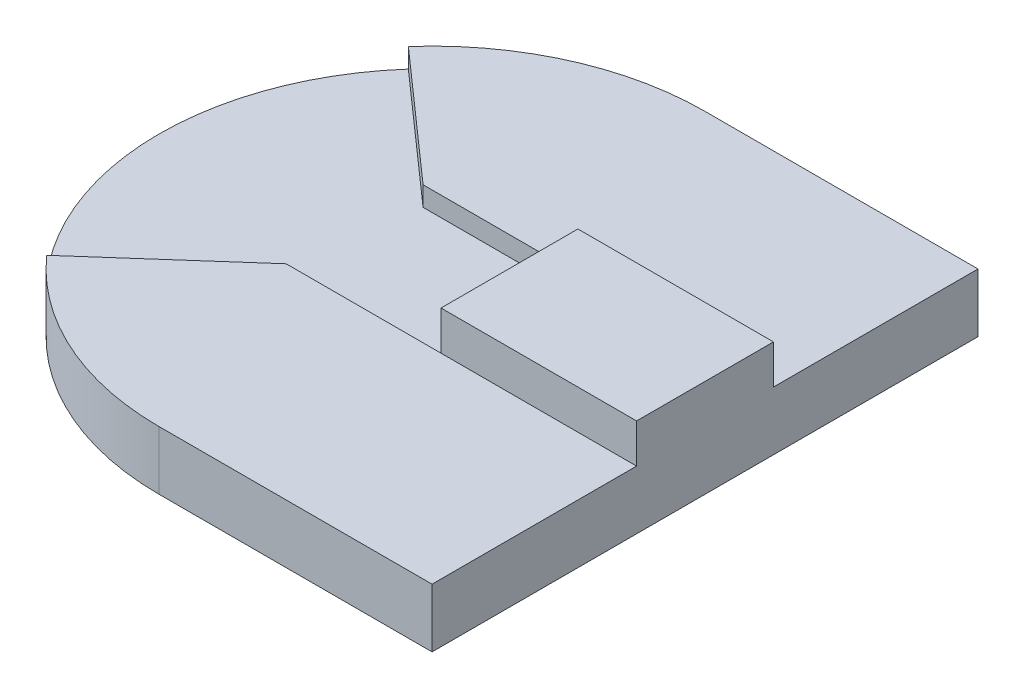
ISO-10303-21;
HEADER;
FILE_DESCRIPTION(('STEP AP214'),'2;1');
FILE_NAME('part.step','',(''),(''),'','','');
FILE_SCHEMA(('AUTOMOTIVE_DESIGN { 1 0 10303 214 1 1 1 1 }'));
ENDSEC;
DATA;
#1=APPLICATION_CONTEXT('core data for automotive mechanical design processes');
#2=APPLICATION_PROTOCOL_DEFINITION('international standard','automotive_design',2000,#1);
#3=PRODUCT_CONTEXT('',#1,'mechanical');
#4=PRODUCT('Part','Part','',(#3));
#5=PRODUCT_RELATED_PRODUCT_CATEGORY('part','',(#4));
#6=PRODUCT_DEFINITION_FORMATION('','',#4);
#7=PRODUCT_DEFINITION_CONTEXT('part definition',#1,'design');
#8=PRODUCT_DEFINITION('design','',#6,#7);
#9=PRODUCT_DEFINITION_SHAPE('','',#8);
#10=(LENGTH_UNIT() NAMED_UNIT(*) SI_UNIT(.MILLI.,.METRE.));
#11=(NAMED_UNIT(*) PLANE_ANGLE_UNIT() SI_UNIT($,.RADIAN.));
#12=(NAMED_UNIT(*) SI_UNIT($,.STERADIAN.) SOLID_ANGLE_UNIT());
#13=UNCERTAINTY_MEASURE_WITH_UNIT(LENGTH_MEASURE(1.E-05),#10,'distance_accuracy_value','');
#14=(GEOMETRIC_REPRESENTATION_CONTEXT(3) GLOBAL_UNCERTAINTY_ASSIGNED_CONTEXT((#13)) GLOBAL_UNIT_ASSIGNED_CONTEXT((#10,
#11,#12)) REPRESENTATION_CONTEXT('',''));
#15=CARTESIAN_POINT('',(0.,0.,0.));
#16=DIRECTION('',(0.,0.,1.));
#17=DIRECTION('',(1.,0.,0.));
#18=AXIS2_PLACEMENT_3D('',#15,#16,#17);
#19=CARTESIAN_POINT('',(-10.4038870848723,2.,0.));
#20=DIRECTION('',(0.,-1.,0.));
#21=DIRECTION('',(0.,0.,-1.));
#22=AXIS2_PLACEMENT_3D('',#19,#20,#21);
#23=CYLINDRICAL_SURFACE('',#22,13.958534191634);
#24=CARTESIAN_POINT('',(-10.4038870848723,0.,0.));
#25=DIRECTION('',(0.,1.,0.));
#26=DIRECTION('',(0.,0.,1.));
#27=AXIS2_PLACEMENT_3D('',#24,#25,#26);
#28=CIRCLE('',#27,13.958534191634);
#29=CARTESIAN_POINT('',(-10.4038870848723,0.,-13.958534191634));
#30=VERTEX_POINT('',#29);
#31=CARTESIAN_POINT('',(-10.4038870848723,0.,13.958534191634));
#32=VERTEX_POINT('',#31);
#33=EDGE_CURVE('E44',#30,#32,#28,.T.);
#34=ORIENTED_EDGE('',*,*,#33,.T.);
#35=DIRECTION('',(0.,-1.,0.));
#36=VECTOR('',#35,1.);
#37=CARTESIAN_POINT('',(-10.4038870848723,3.,13.958534191634));
#38=LINE('',#37,#36);
#39=CARTESIAN_POINT('',(-10.4038870848723,3.,13.958534191634));
#40=VERTEX_POINT('',#39);
#41=EDGE_CURVE('E206',#40,#32,#38,.T.);
#42=ORIENTED_EDGE('',*,*,#41,.F.);
#43=CARTESIAN_POINT('',(-10.4038870848723,3.,0.));
#44=DIRECTION('',(0.,1.,0.));
#45=DIRECTION('',(0.,0.,1.));
#46=AXIS2_PLACEMENT_3D('',#43,#44,#45);
#47=CIRCLE('',#46,13.958534191634);
#48=CARTESIAN_POINT('',(-20.8611147476651,3.,9.2459216083383));
#49=VERTEX_POINT('',#48);
#50=EDGE_CURVE('E180',#49,#40,#47,.T.);
#51=ORIENTED_EDGE('',*,*,#50,.F.);
#52=DIRECTION('',(0.,-1.,0.));
#53=VECTOR('',#52,1.);
#54=CARTESIAN_POINT('',(-20.8611147476651,3.,9.2459216083383));
#55=LINE('',#54,#53);
#56=CARTESIAN_POINT('',(-20.8611147476651,2.,9.2459216083383));
#57=VERTEX_POINT('',#56);
#58=EDGE_CURVE('E210',#49,#57,#55,.T.);
#59=ORIENTED_EDGE('',*,*,#58,.T.);
#60=CARTESIAN_POINT('',(-10.4038870848723,2.,0.));
#61=DIRECTION('',(0.,1.,0.));
#62=DIRECTION('',(0.,0.,1.));
#63=AXIS2_PLACEMENT_3D('',#60,#61,#62);
#64=CIRCLE('',#63,13.958534191634);
#65=CARTESIAN_POINT('',(-20.8611147476651,2.,-9.2459216083383));
#66=VERTEX_POINT('',#65);
#67=EDGE_CURVE('E11',#66,#57,#64,.T.);
#68=ORIENTED_EDGE('',*,*,#67,.F.);
#69=DIRECTION('',(0.,-1.,0.));
#70=VECTOR('',#69,1.);
#71=CARTESIAN_POINT('',(-20.8611147476651,3.,-9.2459216083383));
#72=LINE('',#71,#70);
#73=CARTESIAN_POINT('',(-20.8611147476651,3.,-9.2459216083383));
#74=VERTEX_POINT('',#73);
#75=EDGE_CURVE('E244',#74,#66,#72,.T.);
#76=ORIENTED_EDGE('',*,*,#75,.F.);
#77=CARTESIAN_POINT('',(-10.4038870848723,3.,0.));
#78=DIRECTION('',(0.,1.,0.));
#79=DIRECTION('',(0.,0.,1.));
#80=AXIS2_PLACEMENT_3D('',#77,#78,#79);
#81=CIRCLE('',#80,13.958534191634);
#82=CARTESIAN_POINT('',(-10.4038870848723,3.,-13.958534191634));
#83=VERTEX_POINT('',#82);
#84=EDGE_CURVE('E227',#83,#74,#81,.T.);
#85=ORIENTED_EDGE('',*,*,#84,.F.);
#86=DIRECTION('',(0.,-1.,0.));
#87=VECTOR('',#86,1.);
#88=CARTESIAN_POINT('',(-10.4038870848723,3.,-13.958534191634));
#89=LINE('',#88,#87);
#90=EDGE_CURVE('E248',#83,#30,#89,.T.);
#91=ORIENTED_EDGE('',*,*,#90,.T.);
#92=EDGE_LOOP('',(#34,#42,#51,#59,#68,#76,#85,#91));
#93=FACE_BOUND('',#92,.T.);
#94=ADVANCED_FACE('F41',(#93),#23,.T.);
#95=CARTESIAN_POINT('',(0.,2.,0.));
#96=DIRECTION('',(0.,1.,0.));
#97=DIRECTION('',(0.,0.,1.));
#98=AXIS2_PLACEMENT_3D('',#95,#96,#97);
#99=PLANE('',#98);
#100=DIRECTION('',(-0.749163738772819,0.,0.662384852263343));
#101=VECTOR('',#100,1.);
#102=CARTESIAN_POINT('',(-4.56474387492331,2.,-5.16276991569591));
#103=LINE('',#102,#101);
#104=CARTESIAN_POINT('',(-14.3624212765063,2.,3.5));
#105=VERTEX_POINT('',#104);
#106=EDGE_CURVE('E255',#105,#57,#103,.T.);
#107=ORIENTED_EDGE('',*,*,#106,.F.);
#108=DIRECTION('',(-1.,0.,0.));
#109=VECTOR('',#108,1.);
#110=CARTESIAN_POINT('',(0.,2.,3.5));
#111=LINE('',#110,#109);
#112=CARTESIAN_POINT('',(-6.44535289323834,2.,3.5));
#113=VERTEX_POINT('',#112);
#114=EDGE_CURVE('E258',#113,#105,#111,.T.);
#115=ORIENTED_EDGE('',*,*,#114,.F.);
#116=DIRECTION('',(0.,0.,1.));
#117=VECTOR('',#116,1.);
#118=CARTESIAN_POINT('',(-6.44535289323834,2.,0.));
#119=LINE('',#118,#117);
#120=CARTESIAN_POINT('',(-6.44535289323834,2.,-3.5));
#121=VERTEX_POINT('',#120);
#122=EDGE_CURVE('E261',#121,#113,#119,.T.);
#123=ORIENTED_EDGE('',*,*,#122,.F.);
#124=DIRECTION('',(-1.,0.,0.));
#125=VECTOR('',#124,1.);
#126=CARTESIAN_POINT('',(0.,2.,-3.5));
#127=LINE('',#126,#125);
#128=CARTESIAN_POINT('',(-14.3624212765063,2.,-3.5));
#129=VERTEX_POINT('',#128);
#130=EDGE_CURVE('E264',#121,#129,#127,.T.);
#131=ORIENTED_EDGE('',*,*,#130,.T.);
#132=DIRECTION('',(-0.749163738772819,0.,-0.662384852263343));
#133=VECTOR('',#132,1.);
#134=CARTESIAN_POINT('',(-4.5647438749233,2.,5.16276991569591));
#135=LINE('',#134,#133);
#136=EDGE_CURVE('E50',#129,#66,#135,.T.);
#137=ORIENTED_EDGE('',*,*,#136,.T.);
#138=ORIENTED_EDGE('',*,*,#67,.T.);
#139=EDGE_LOOP('',(#107,#115,#123,#131,#137,#138));
#140=FACE_BOUND('',#139,.T.);
#141=ADVANCED_FACE('F280',(#140),#99,.T.);
#142=CARTESIAN_POINT('',(0.,0.,0.));
#143=DIRECTION('',(0.,1.,0.));
#144=DIRECTION('',(0.,0.,1.));
#145=AXIS2_PLACEMENT_3D('',#142,#143,#144);
#146=PLANE('',#145);
#147=DIRECTION('',(1.,0.,0.));
#148=VECTOR('',#147,1.);
#149=CARTESIAN_POINT('',(0.,0.,13.958534191634));
#150=LINE('',#149,#148);
#151=CARTESIAN_POINT('',(3.55464710676166,0.,13.958534191634));
#152=VERTEX_POINT('',#151);
#153=EDGE_CURVE('E143',#32,#152,#150,.T.);
#154=ORIENTED_EDGE('',*,*,#153,.F.);
#155=ORIENTED_EDGE('',*,*,#33,.F.);
#156=DIRECTION('',(1.,0.,0.));
#157=VECTOR('',#156,1.);
#158=CARTESIAN_POINT('',(0.,0.,-13.958534191634));
#159=LINE('',#158,#157);
#160=CARTESIAN_POINT('',(3.55464710676166,0.,-13.958534191634));
#161=VERTEX_POINT('',#160);
#162=EDGE_CURVE('E237',#30,#161,#159,.T.);
#163=ORIENTED_EDGE('',*,*,#162,.T.);
#164=DIRECTION('',(0.,0.,1.));
#165=VECTOR('',#164,1.);
#166=CARTESIAN_POINT('',(3.55464710676166,0.,0.));
#167=LINE('',#166,#165);
#168=EDGE_CURVE('E214',#161,#152,#167,.T.);
#169=ORIENTED_EDGE('',*,*,#168,.T.);
#170=EDGE_LOOP('',(#154,#155,#163,#169));
#171=FACE_BOUND('',#170,.T.);
#172=ADVANCED_FACE('F319',(#171),#146,.F.);
#173=CARTESIAN_POINT('',(0.,3.,-3.5));
#174=DIRECTION('',(0.,0.,1.));
#175=DIRECTION('',(1.,0.,0.));
#176=AXIS2_PLACEMENT_3D('',#173,#174,#175);
#177=PLANE('',#176);
#178=DIRECTION('',(0.,-1.,0.));
#179=VECTOR('',#178,1.);
#180=CARTESIAN_POINT('',(-6.44535289323834,5.,-3.5));
#181=LINE('',#180,#179);
#182=CARTESIAN_POINT('',(-6.44535289323834,3.,-3.5));
#183=VERTEX_POINT('',#182);
#184=EDGE_CURVE('E167',#183,#121,#181,.T.);
#185=ORIENTED_EDGE('',*,*,#184,.F.);
#186=DIRECTION('',(-1.,0.,0.));
#187=VECTOR('',#186,1.);
#188=CARTESIAN_POINT('',(0.,3.,-3.5));
#189=LINE('',#188,#187);
#190=CARTESIAN_POINT('',(-14.3624212765063,3.,-3.5));
#191=VERTEX_POINT('',#190);
#192=EDGE_CURVE('E219',#183,#191,#189,.T.);
#193=ORIENTED_EDGE('',*,*,#192,.T.);
#194=DIRECTION('',(0.,-1.,0.));
#195=VECTOR('',#194,1.);
#196=CARTESIAN_POINT('',(-14.3624212765063,3.,-3.5));
#197=LINE('',#196,#195);
#198=EDGE_CURVE('E234',#191,#129,#197,.T.);
#199=ORIENTED_EDGE('',*,*,#198,.T.);
#200=ORIENTED_EDGE('',*,*,#130,.F.);
#201=EDGE_LOOP('',(#185,#193,#199,#200));
#202=FACE_BOUND('',#201,.T.);
#203=ADVANCED_FACE('F281',(#202),#177,.T.);
#204=CARTESIAN_POINT('',(3.55464710676166,3.,0.));
#205=DIRECTION('',(1.,0.,0.));
#206=DIRECTION('',(0.,0.,-1.));
#207=AXIS2_PLACEMENT_3D('',#204,#205,#206);
#208=PLANE('',#207);
#209=ORIENTED_EDGE('',*,*,#168,.F.);
#210=DIRECTION('',(0.,-1.,0.));
#211=VECTOR('',#210,1.);
#212=CARTESIAN_POINT('',(3.55464710676166,3.,-13.958534191634));
#213=LINE('',#212,#211);
#214=CARTESIAN_POINT('',(3.55464710676166,3.,-13.958534191634));
#215=VERTEX_POINT('',#214);
#216=EDGE_CURVE('E252',#215,#161,#213,.T.);
#217=ORIENTED_EDGE('',*,*,#216,.F.);
#218=DIRECTION('',(0.,0.,1.));
#219=VECTOR('',#218,1.);
#220=CARTESIAN_POINT('',(3.55464710676166,3.,0.));
#221=LINE('',#220,#219);
#222=CARTESIAN_POINT('',(3.55464710676166,3.,-3.5));
#223=VERTEX_POINT('',#222);
#224=EDGE_CURVE('E218',#215,#223,#221,.T.);
#225=ORIENTED_EDGE('',*,*,#224,.T.);
#226=DIRECTION('',(0.,-1.,0.));
#227=VECTOR('',#226,1.);
#228=CARTESIAN_POINT('',(3.55464710676166,5.,-3.5));
#229=LINE('',#228,#227);
#230=CARTESIAN_POINT('',(3.55464710676166,5.,-3.5));
#231=VERTEX_POINT('',#230);
#232=EDGE_CURVE('E171',#231,#223,#229,.T.);
#233=ORIENTED_EDGE('',*,*,#232,.F.);
#234=DIRECTION('',(0.,0.,1.));
#235=VECTOR('',#234,1.);
#236=CARTESIAN_POINT('',(3.55464710676166,5.,0.));
#237=LINE('',#236,#235);
#238=CARTESIAN_POINT('',(3.55464710676166,5.,3.5));
#239=VERTEX_POINT('',#238);
#240=EDGE_CURVE('E160',#231,#239,#237,.T.);
#241=ORIENTED_EDGE('',*,*,#240,.T.);
#242=DIRECTION('',(0.,-1.,0.));
#243=VECTOR('',#242,1.);
#244=CARTESIAN_POINT('',(3.55464710676166,5.,3.5));
#245=LINE('',#244,#243);
#246=CARTESIAN_POINT('',(3.55464710676166,3.,3.5));
#247=VERTEX_POINT('',#246);
#248=EDGE_CURVE('E158',#239,#247,#245,.T.);
#249=ORIENTED_EDGE('',*,*,#248,.T.);
#250=DIRECTION('',(0.,0.,1.));
#251=VECTOR('',#250,1.);
#252=CARTESIAN_POINT('',(3.55464710676166,3.,0.));
#253=LINE('',#252,#251);
#254=CARTESIAN_POINT('',(3.55464710676166,3.,13.958534191634));
#255=VERTEX_POINT('',#254);
#256=EDGE_CURVE('E186',#247,#255,#253,.T.);
#257=ORIENTED_EDGE('',*,*,#256,.T.);
#258=DIRECTION('',(0.,-1.,0.));
#259=VECTOR('',#258,1.);
#260=CARTESIAN_POINT('',(3.55464710676166,3.,13.958534191634));
#261=LINE('',#260,#259);
#262=EDGE_CURVE('E202',#255,#152,#261,.T.);
#263=ORIENTED_EDGE('',*,*,#262,.T.);
#264=EDGE_LOOP('',(#209,#217,#225,#233,#241,#249,#257,#263));
#265=FACE_BOUND('',#264,.T.);
#266=ADVANCED_FACE('F306',(#265),#208,.T.);
#267=CARTESIAN_POINT('',(0.,3.,-13.958534191634));
#268=DIRECTION('',(0.,0.,-1.));
#269=DIRECTION('',(-1.,0.,0.));
#270=AXIS2_PLACEMENT_3D('',#267,#268,#269);
#271=PLANE('',#270);
#272=ORIENTED_EDGE('',*,*,#162,.F.);
#273=ORIENTED_EDGE('',*,*,#90,.F.);
#274=DIRECTION('',(1.,0.,0.));
#275=VECTOR('',#274,1.);
#276=CARTESIAN_POINT('',(0.,3.,-13.958534191634));
#277=LINE('',#276,#275);
#278=EDGE_CURVE('E223',#83,#215,#277,.T.);
#279=ORIENTED_EDGE('',*,*,#278,.T.);
#280=ORIENTED_EDGE('',*,*,#216,.T.);
#281=EDGE_LOOP('',(#272,#273,#279,#280));
#282=FACE_BOUND('',#281,.T.);
#283=ADVANCED_FACE('F311',(#282),#271,.T.);
#284=CARTESIAN_POINT('',(-4.5647438749233,3.,5.16276991569591));
#285=DIRECTION('',(-0.662384852263343,0.,0.749163738772819));
#286=DIRECTION('',(0.749163738772819,0.,0.662384852263343));
#287=AXIS2_PLACEMENT_3D('',#284,#285,#286);
#288=PLANE('',#287);
#289=ORIENTED_EDGE('',*,*,#75,.T.);
#290=ORIENTED_EDGE('',*,*,#136,.F.);
#291=ORIENTED_EDGE('',*,*,#198,.F.);
#292=DIRECTION('',(-0.749163738772819,0.,-0.662384852263343));
#293=VECTOR('',#292,1.);
#294=CARTESIAN_POINT('',(-4.5647438749233,3.,5.16276991569591));
#295=LINE('',#294,#293);
#296=EDGE_CURVE('E230',#191,#74,#295,.T.);
#297=ORIENTED_EDGE('',*,*,#296,.T.);
#298=EDGE_LOOP('',(#289,#290,#291,#297));
#299=FACE_BOUND('',#298,.T.);
#300=ADVANCED_FACE('F285',(#299),#288,.T.);
#301=CARTESIAN_POINT('',(0.,3.,0.));
#302=DIRECTION('',(0.,1.,0.));
#303=DIRECTION('',(0.,0.,1.));
#304=AXIS2_PLACEMENT_3D('',#301,#302,#303);
#305=PLANE('',#304);
#306=EDGE_CURVE('E215',#223,#183,#189,.T.);
#307=ORIENTED_EDGE('',*,*,#306,.F.);
#308=ORIENTED_EDGE('',*,*,#224,.F.);
#309=ORIENTED_EDGE('',*,*,#278,.F.);
#310=ORIENTED_EDGE('',*,*,#84,.T.);
#311=ORIENTED_EDGE('',*,*,#296,.F.);
#312=ORIENTED_EDGE('',*,*,#192,.F.);
#313=EDGE_LOOP('',(#307,#308,#309,#310,#311,#312));
#314=FACE_BOUND('',#313,.T.);
#315=ADVANCED_FACE('F288',(#314),#305,.T.);
#316=CARTESIAN_POINT('',(-4.56474387492331,3.,-5.16276991569591));
#317=DIRECTION('',(0.662384852263343,0.,0.749163738772819));
#318=DIRECTION('',(0.749163738772819,0.,-0.662384852263343));
#319=AXIS2_PLACEMENT_3D('',#316,#317,#318);
#320=PLANE('',#319);
#321=ORIENTED_EDGE('',*,*,#106,.T.);
#322=ORIENTED_EDGE('',*,*,#58,.F.);
#323=DIRECTION('',(-0.749163738772819,0.,0.662384852263343));
#324=VECTOR('',#323,1.);
#325=CARTESIAN_POINT('',(-4.56474387492331,3.,-5.16276991569591));
#326=LINE('',#325,#324);
#327=CARTESIAN_POINT('',(-14.3624212765063,3.,3.5));
#328=VERTEX_POINT('',#327);
#329=EDGE_CURVE('E176',#328,#49,#326,.T.);
#330=ORIENTED_EDGE('',*,*,#329,.F.);
#331=DIRECTION('',(0.,-1.,0.));
#332=VECTOR('',#331,1.);
#333=CARTESIAN_POINT('',(-14.3624212765063,3.,3.5));
#334=LINE('',#333,#332);
#335=EDGE_CURVE('E195',#328,#105,#334,.T.);
#336=ORIENTED_EDGE('',*,*,#335,.T.);
#337=EDGE_LOOP('',(#321,#322,#330,#336));
#338=FACE_BOUND('',#337,.T.);
#339=ADVANCED_FACE('F296',(#338),#320,.F.);
#340=CARTESIAN_POINT('',(0.,3.,13.958534191634));
#341=DIRECTION('',(0.,0.,-1.));
#342=DIRECTION('',(-1.,0.,0.));
#343=AXIS2_PLACEMENT_3D('',#340,#341,#342);
#344=PLANE('',#343);
#345=ORIENTED_EDGE('',*,*,#153,.T.);
#346=ORIENTED_EDGE('',*,*,#262,.F.);
#347=DIRECTION('',(1.,0.,0.));
#348=VECTOR('',#347,1.);
#349=CARTESIAN_POINT('',(0.,3.,13.958534191634));
#350=LINE('',#349,#348);
#351=EDGE_CURVE('E183',#40,#255,#350,.T.);
#352=ORIENTED_EDGE('',*,*,#351,.F.);
#353=ORIENTED_EDGE('',*,*,#41,.T.);
#354=EDGE_LOOP('',(#345,#346,#352,#353));
#355=FACE_BOUND('',#354,.T.);
#356=ADVANCED_FACE('F317',(#355),#344,.F.);
#357=CARTESIAN_POINT('',(0.,3.,3.5));
#358=DIRECTION('',(0.,0.,1.));
#359=DIRECTION('',(1.,0.,0.));
#360=AXIS2_PLACEMENT_3D('',#357,#358,#359);
#361=PLANE('',#360);
#362=DIRECTION('',(-1.,0.,0.));
#363=VECTOR('',#362,1.);
#364=CARTESIAN_POINT('',(0.,3.,3.5));
#365=LINE('',#364,#363);
#366=CARTESIAN_POINT('',(-6.44535289323834,3.,3.5));
#367=VERTEX_POINT('',#366);
#368=EDGE_CURVE('E190',#367,#328,#365,.T.);
#369=ORIENTED_EDGE('',*,*,#368,.F.);
#370=DIRECTION('',(0.,-1.,0.));
#371=VECTOR('',#370,1.);
#372=CARTESIAN_POINT('',(-6.44535289323834,5.,3.5));
#373=LINE('',#372,#371);
#374=EDGE_CURVE('E140',#367,#113,#373,.T.);
#375=ORIENTED_EDGE('',*,*,#374,.T.);
#376=ORIENTED_EDGE('',*,*,#114,.T.);
#377=ORIENTED_EDGE('',*,*,#335,.F.);
#378=EDGE_LOOP('',(#369,#375,#376,#377));
#379=FACE_BOUND('',#378,.T.);
#380=ADVANCED_FACE('F300',(#379),#361,.F.);
#381=CARTESIAN_POINT('',(0.,3.,0.));
#382=DIRECTION('',(0.,1.,0.));
#383=DIRECTION('',(0.,0.,1.));
#384=AXIS2_PLACEMENT_3D('',#381,#382,#383);
#385=PLANE('',#384);
#386=ORIENTED_EDGE('',*,*,#329,.T.);
#387=ORIENTED_EDGE('',*,*,#50,.T.);
#388=ORIENTED_EDGE('',*,*,#351,.T.);
#389=ORIENTED_EDGE('',*,*,#256,.F.);
#390=EDGE_CURVE('E191',#247,#367,#365,.T.);
#391=ORIENTED_EDGE('',*,*,#390,.T.);
#392=ORIENTED_EDGE('',*,*,#368,.T.);
#393=EDGE_LOOP('',(#386,#387,#388,#389,#391,#392));
#394=FACE_BOUND('',#393,.T.);
#395=ADVANCED_FACE('F303',(#394),#385,.T.);
#396=CARTESIAN_POINT('',(-6.44535289323834,5.,0.));
#397=DIRECTION('',(-1.,0.,0.));
#398=DIRECTION('',(0.,0.,1.));
#399=AXIS2_PLACEMENT_3D('',#396,#397,#398);
#400=PLANE('',#399);
#401=ORIENTED_EDGE('',*,*,#184,.T.);
#402=ORIENTED_EDGE('',*,*,#122,.T.);
#403=ORIENTED_EDGE('',*,*,#374,.F.);
#404=CARTESIAN_POINT('',(-6.44535289323834,5.,3.5));
#405=VERTEX_POINT('',#404);
#406=EDGE_CURVE('E57',#405,#367,#373,.T.);
#407=ORIENTED_EDGE('',*,*,#406,.F.);
#408=DIRECTION('',(0.,0.,-1.));
#409=VECTOR('',#408,1.);
#410=CARTESIAN_POINT('',(-6.44535289323834,5.,0.));
#411=LINE('',#410,#409);
#412=CARTESIAN_POINT('',(-6.44535289323834,5.,-3.5));
#413=VERTEX_POINT('',#412);
#414=EDGE_CURVE('E138',#405,#413,#411,.T.);
#415=ORIENTED_EDGE('',*,*,#414,.T.);
#416=EDGE_CURVE('E168',#413,#183,#181,.T.);
#417=ORIENTED_EDGE('',*,*,#416,.T.);
#418=EDGE_LOOP('',(#401,#402,#403,#407,#415,#417));
#419=FACE_BOUND('',#418,.T.);
#420=ADVANCED_FACE('F136',(#419),#400,.T.);
#421=CARTESIAN_POINT('',(0.,5.,3.5));
#422=DIRECTION('',(0.,0.,1.));
#423=DIRECTION('',(1.,0.,0.));
#424=AXIS2_PLACEMENT_3D('',#421,#422,#423);
#425=PLANE('',#424);
#426=ORIENTED_EDGE('',*,*,#406,.T.);
#427=ORIENTED_EDGE('',*,*,#390,.F.);
#428=ORIENTED_EDGE('',*,*,#248,.F.);
#429=DIRECTION('',(-1.,0.,0.));
#430=VECTOR('',#429,1.);
#431=CARTESIAN_POINT('',(0.,5.,3.5));
#432=LINE('',#431,#430);
#433=EDGE_CURVE('E149',#239,#405,#432,.T.);
#434=ORIENTED_EDGE('',*,*,#433,.T.);
#435=EDGE_LOOP('',(#426,#427,#428,#434));
#436=FACE_BOUND('',#435,.T.);
#437=ADVANCED_FACE('F156',(#436),#425,.T.);
#438=CARTESIAN_POINT('',(0.,5.,-3.5));
#439=DIRECTION('',(0.,0.,1.));
#440=DIRECTION('',(1.,0.,0.));
#441=AXIS2_PLACEMENT_3D('',#438,#439,#440);
#442=PLANE('',#441);
#443=ORIENTED_EDGE('',*,*,#306,.T.);
#444=ORIENTED_EDGE('',*,*,#416,.F.);
#445=DIRECTION('',(-1.,0.,0.));
#446=VECTOR('',#445,1.);
#447=CARTESIAN_POINT('',(0.,5.,-3.5));
#448=LINE('',#447,#446);
#449=EDGE_CURVE('E152',#231,#413,#448,.T.);
#450=ORIENTED_EDGE('',*,*,#449,.F.);
#451=ORIENTED_EDGE('',*,*,#232,.T.);
#452=EDGE_LOOP('',(#443,#444,#450,#451));
#453=FACE_BOUND('',#452,.T.);
#454=ADVANCED_FACE('F308',(#453),#442,.F.);
#455=CARTESIAN_POINT('',(0.,5.,0.));
#456=DIRECTION('',(0.,1.,0.));
#457=DIRECTION('',(0.,0.,1.));
#458=AXIS2_PLACEMENT_3D('',#455,#456,#457);
#459=PLANE('',#458);
#460=ORIENTED_EDGE('',*,*,#414,.F.);
#461=ORIENTED_EDGE('',*,*,#433,.F.);
#462=ORIENTED_EDGE('',*,*,#240,.F.);
#463=ORIENTED_EDGE('',*,*,#449,.T.);
#464=EDGE_LOOP('',(#460,#461,#462,#463));
#465=FACE_BOUND('',#464,.T.);
#466=ADVANCED_FACE('F147',(#465),#459,.T.);
#467=CLOSED_SHELL('',(#94,#141,#172,#203,#266,#283,#300,#315,#339,#356,#380,#395,#420,#437,#454,#466));
#468=MANIFOLD_SOLID_BREP('B2',#467);
#469=ADVANCED_BREP_SHAPE_REPRESENTATION('',(#18,#468),#14);
#470=SHAPE_DEFINITION_REPRESENTATION(#9,#469);
ENDSEC;
END-ISO-10303-21;
